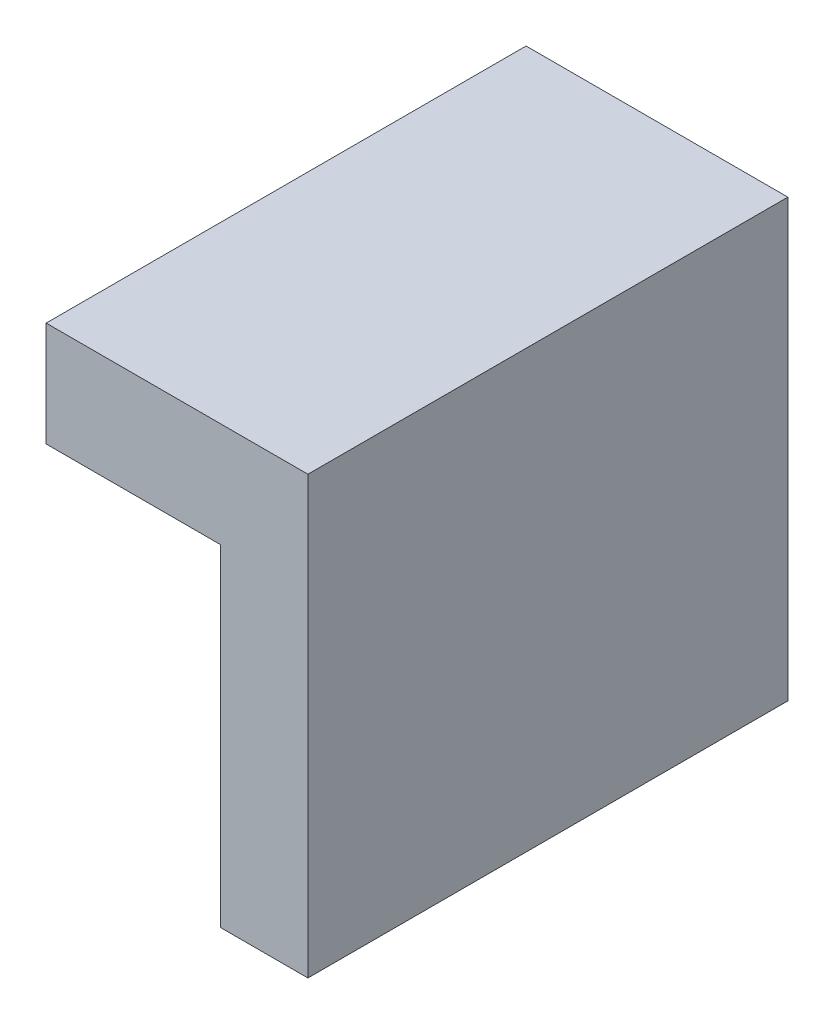
ISO-10303-21;
HEADER;
FILE_DESCRIPTION(('STEP AP214'),'2;1');
FILE_NAME('part.step','',(''),(''),'','','');
FILE_SCHEMA(('AUTOMOTIVE_DESIGN { 1 0 10303 214 1 1 1 1 }'));
ENDSEC;
DATA;
#1=APPLICATION_CONTEXT('core data for automotive mechanical design processes');
#2=APPLICATION_PROTOCOL_DEFINITION('international standard','automotive_design',2000,#1);
#3=PRODUCT_CONTEXT('',#1,'mechanical');
#4=PRODUCT('Part','Part','',(#3));
#5=PRODUCT_RELATED_PRODUCT_CATEGORY('part','',(#4));
#6=PRODUCT_DEFINITION_FORMATION('','',#4);
#7=PRODUCT_DEFINITION_CONTEXT('part definition',#1,'design');
#8=PRODUCT_DEFINITION('design','',#6,#7);
#9=PRODUCT_DEFINITION_SHAPE('','',#8);
#10=(LENGTH_UNIT() NAMED_UNIT(*) SI_UNIT(.MILLI.,.METRE.));
#11=(NAMED_UNIT(*) PLANE_ANGLE_UNIT() SI_UNIT($,.RADIAN.));
#12=(NAMED_UNIT(*) SI_UNIT($,.STERADIAN.) SOLID_ANGLE_UNIT());
#13=UNCERTAINTY_MEASURE_WITH_UNIT(LENGTH_MEASURE(1.E-05),#10,'distance_accuracy_value','');
#14=(GEOMETRIC_REPRESENTATION_CONTEXT(3) GLOBAL_UNCERTAINTY_ASSIGNED_CONTEXT((#13)) GLOBAL_UNIT_ASSIGNED_CONTEXT((#10,
#11,#12)) REPRESENTATION_CONTEXT('',''));
#15=CARTESIAN_POINT('',(0.,0.,0.));
#16=DIRECTION('',(0.,0.,1.));
#17=DIRECTION('',(1.,0.,0.));
#18=AXIS2_PLACEMENT_3D('',#15,#16,#17);
#19=CARTESIAN_POINT('',(0.,0.,50.));
#20=DIRECTION('',(0.,0.,1.));
#21=DIRECTION('',(1.,0.,0.));
#22=AXIS2_PLACEMENT_3D('',#19,#20,#21);
#23=PLANE('',#22);
#24=DIRECTION('',(-1.,0.,0.));
#25=VECTOR('',#24,1.);
#26=CARTESIAN_POINT('',(0.,20.,50.));
#27=LINE('',#26,#25);
#28=CARTESIAN_POINT('',(12.,20.,50.));
#29=VERTEX_POINT('',#28);
#30=CARTESIAN_POINT('',(-15.,20.,50.));
#31=VERTEX_POINT('',#30);
#32=EDGE_CURVE('E12',#29,#31,#27,.T.);
#33=ORIENTED_EDGE('',*,*,#32,.F.);
#34=DIRECTION('',(0.,1.,0.));
#35=VECTOR('',#34,1.);
#36=CARTESIAN_POINT('',(12.,0.,50.));
#37=LINE('',#36,#35);
#38=CARTESIAN_POINT('',(12.,-25.,50.));
#39=VERTEX_POINT('',#38);
#40=EDGE_CURVE('E83',#39,#29,#37,.T.);
#41=ORIENTED_EDGE('',*,*,#40,.F.);
#42=DIRECTION('',(1.,0.,0.));
#43=VECTOR('',#42,1.);
#44=CARTESIAN_POINT('',(0.,-25.,50.));
#45=LINE('',#44,#43);
#46=CARTESIAN_POINT('',(9.,-25.,50.));
#47=VERTEX_POINT('',#46);
#48=EDGE_CURVE('E199',#47,#39,#45,.T.);
#49=ORIENTED_EDGE('',*,*,#48,.F.);
#50=DIRECTION('',(0.,-1.,0.));
#51=VECTOR('',#50,1.);
#52=CARTESIAN_POINT('',(9.,0.,50.));
#53=LINE('',#52,#51);
#54=CARTESIAN_POINT('',(9.,17.,50.));
#55=VERTEX_POINT('',#54);
#56=EDGE_CURVE('E216',#55,#47,#53,.T.);
#57=ORIENTED_EDGE('',*,*,#56,.F.);
#58=DIRECTION('',(1.,0.,0.));
#59=VECTOR('',#58,1.);
#60=CARTESIAN_POINT('',(0.,17.,50.));
#61=LINE('',#60,#59);
#62=CARTESIAN_POINT('',(-15.,17.,50.));
#63=VERTEX_POINT('',#62);
#64=EDGE_CURVE('E210',#63,#55,#61,.T.);
#65=ORIENTED_EDGE('',*,*,#64,.F.);
#66=DIRECTION('',(0.,1.,0.));
#67=VECTOR('',#66,1.);
#68=CARTESIAN_POINT('',(-15.,0.,50.));
#69=LINE('',#68,#67);
#70=EDGE_CURVE('E197',#63,#31,#69,.T.);
#71=ORIENTED_EDGE('',*,*,#70,.T.);
#72=EDGE_LOOP('',(#33,#41,#49,#57,#65,#71));
#73=FACE_BOUND('',#72,.T.);
#74=ADVANCED_FACE('F75',(#73),#23,.F.);
#75=CARTESIAN_POINT('',(9.,0.,55.));
#76=DIRECTION('',(1.,0.,0.));
#77=DIRECTION('',(0.,1.,0.));
#78=AXIS2_PLACEMENT_3D('',#75,#76,#77);
#79=PLANE('',#78);
#80=DIRECTION('',(0.,0.,-1.));
#81=VECTOR('',#80,1.);
#82=CARTESIAN_POINT('',(9.,17.,55.));
#83=LINE('',#82,#81);
#84=CARTESIAN_POINT('',(9.,17.,0.));
#85=VERTEX_POINT('',#84);
#86=EDGE_CURVE('E249',#55,#85,#83,.T.);
#87=ORIENTED_EDGE('',*,*,#86,.F.);
#88=ORIENTED_EDGE('',*,*,#56,.T.);
#89=DIRECTION('',(0.,0.,-1.));
#90=VECTOR('',#89,1.);
#91=CARTESIAN_POINT('',(9.,-25.,55.));
#92=LINE('',#91,#90);
#93=CARTESIAN_POINT('',(9.,-25.,0.));
#94=VERTEX_POINT('',#93);
#95=EDGE_CURVE('E251',#47,#94,#92,.T.);
#96=ORIENTED_EDGE('',*,*,#95,.T.);
#97=DIRECTION('',(0.,-1.,0.));
#98=VECTOR('',#97,1.);
#99=CARTESIAN_POINT('',(9.,0.,0.));
#100=LINE('',#99,#98);
#101=EDGE_CURVE('E238',#85,#94,#100,.T.);
#102=ORIENTED_EDGE('',*,*,#101,.F.);
#103=EDGE_LOOP('',(#87,#88,#96,#102));
#104=FACE_BOUND('',#103,.T.);
#105=ADVANCED_FACE('F281',(#104),#79,.T.);
#106=CARTESIAN_POINT('',(0.,17.,55.));
#107=DIRECTION('',(0.,1.,0.));
#108=DIRECTION('',(0.,0.,1.));
#109=AXIS2_PLACEMENT_3D('',#106,#107,#108);
#110=PLANE('',#109);
#111=DIRECTION('',(0.,0.,-1.));
#112=VECTOR('',#111,1.);
#113=CARTESIAN_POINT('',(-15.,17.,55.));
#114=LINE('',#113,#112);
#115=CARTESIAN_POINT('',(-15.,17.,0.));
#116=VERTEX_POINT('',#115);
#117=EDGE_CURVE('E247',#63,#116,#114,.T.);
#118=ORIENTED_EDGE('',*,*,#117,.F.);
#119=ORIENTED_EDGE('',*,*,#64,.T.);
#120=ORIENTED_EDGE('',*,*,#86,.T.);
#121=DIRECTION('',(1.,0.,0.));
#122=VECTOR('',#121,1.);
#123=CARTESIAN_POINT('',(0.,17.,0.));
#124=LINE('',#123,#122);
#125=EDGE_CURVE('E241',#116,#85,#124,.T.);
#126=ORIENTED_EDGE('',*,*,#125,.F.);
#127=EDGE_LOOP('',(#118,#119,#120,#126));
#128=FACE_BOUND('',#127,.T.);
#129=ADVANCED_FACE('F276',(#128),#110,.T.);
#130=CARTESIAN_POINT('',(0.,13.,55.));
#131=DIRECTION('',(0.,1.,0.));
#132=DIRECTION('',(0.,0.,1.));
#133=AXIS2_PLACEMENT_3D('',#130,#131,#132);
#134=PLANE('',#133);
#135=DIRECTION('',(0.,0.,-1.));
#136=VECTOR('',#135,1.);
#137=CARTESIAN_POINT('',(-15.,13.,55.));
#138=LINE('',#137,#136);
#139=CARTESIAN_POINT('',(-15.,13.,55.));
#140=VERTEX_POINT('',#139);
#141=CARTESIAN_POINT('',(-15.,13.,0.));
#142=VERTEX_POINT('',#141);
#143=EDGE_CURVE('E229',#140,#142,#138,.T.);
#144=ORIENTED_EDGE('',*,*,#143,.T.);
#145=DIRECTION('',(1.,0.,0.));
#146=VECTOR('',#145,1.);
#147=CARTESIAN_POINT('',(0.,13.,0.));
#148=LINE('',#147,#146);
#149=CARTESIAN_POINT('',(5.,13.,0.));
#150=VERTEX_POINT('',#149);
#151=EDGE_CURVE('E218',#142,#150,#148,.T.);
#152=ORIENTED_EDGE('',*,*,#151,.T.);
#153=DIRECTION('',(0.,0.,-1.));
#154=VECTOR('',#153,1.);
#155=CARTESIAN_POINT('',(5.,13.,55.));
#156=LINE('',#155,#154);
#157=CARTESIAN_POINT('',(5.,13.,55.));
#158=VERTEX_POINT('',#157);
#159=EDGE_CURVE('E255',#158,#150,#156,.T.);
#160=ORIENTED_EDGE('',*,*,#159,.F.);
#161=DIRECTION('',(1.,0.,0.));
#162=VECTOR('',#161,1.);
#163=CARTESIAN_POINT('',(0.,13.,55.));
#164=LINE('',#163,#162);
#165=EDGE_CURVE('E219',#140,#158,#164,.T.);
#166=ORIENTED_EDGE('',*,*,#165,.F.);
#167=EDGE_LOOP('',(#144,#152,#160,#166));
#168=FACE_BOUND('',#167,.T.);
#169=ADVANCED_FACE('F77',(#168),#134,.F.);
#170=CARTESIAN_POINT('',(5.,0.,55.));
#171=DIRECTION('',(1.,0.,0.));
#172=DIRECTION('',(0.,1.,0.));
#173=AXIS2_PLACEMENT_3D('',#170,#171,#172);
#174=PLANE('',#173);
#175=ORIENTED_EDGE('',*,*,#159,.T.);
#176=DIRECTION('',(0.,-1.,0.));
#177=VECTOR('',#176,1.);
#178=CARTESIAN_POINT('',(5.,0.,0.));
#179=LINE('',#178,#177);
#180=CARTESIAN_POINT('',(5.,-25.,0.));
#181=VERTEX_POINT('',#180);
#182=EDGE_CURVE('E232',#150,#181,#179,.T.);
#183=ORIENTED_EDGE('',*,*,#182,.T.);
#184=DIRECTION('',(0.,0.,-1.));
#185=VECTOR('',#184,1.);
#186=CARTESIAN_POINT('',(5.,-25.,55.));
#187=LINE('',#186,#185);
#188=CARTESIAN_POINT('',(5.,-25.,55.));
#189=VERTEX_POINT('',#188);
#190=EDGE_CURVE('E253',#189,#181,#187,.T.);
#191=ORIENTED_EDGE('',*,*,#190,.F.);
#192=DIRECTION('',(0.,-1.,0.));
#193=VECTOR('',#192,1.);
#194=CARTESIAN_POINT('',(5.,0.,55.));
#195=LINE('',#194,#193);
#196=EDGE_CURVE('E222',#158,#189,#195,.T.);
#197=ORIENTED_EDGE('',*,*,#196,.F.);
#198=EDGE_LOOP('',(#175,#183,#191,#197));
#199=FACE_BOUND('',#198,.T.);
#200=ADVANCED_FACE('F259',(#199),#174,.F.);
#201=CARTESIAN_POINT('',(0.,-25.,55.));
#202=DIRECTION('',(0.,1.,0.));
#203=DIRECTION('',(0.,0.,1.));
#204=AXIS2_PLACEMENT_3D('',#201,#202,#203);
#205=PLANE('',#204);
#206=DIRECTION('',(0.,0.,1.));
#207=VECTOR('',#206,1.);
#208=CARTESIAN_POINT('',(15.,-25.,50.));
#209=LINE('',#208,#207);
#210=CARTESIAN_POINT('',(15.,-25.,0.));
#211=VERTEX_POINT('',#210);
#212=CARTESIAN_POINT('',(15.,-25.,55.));
#213=VERTEX_POINT('',#212);
#214=EDGE_CURVE('E202',#211,#213,#209,.T.);
#215=ORIENTED_EDGE('',*,*,#214,.T.);
#216=DIRECTION('',(1.,0.,0.));
#217=VECTOR('',#216,1.);
#218=CARTESIAN_POINT('',(0.,-25.,55.));
#219=LINE('',#218,#217);
#220=EDGE_CURVE('E225',#189,#213,#219,.T.);
#221=ORIENTED_EDGE('',*,*,#220,.F.);
#222=ORIENTED_EDGE('',*,*,#190,.T.);
#223=DIRECTION('',(1.,0.,0.));
#224=VECTOR('',#223,1.);
#225=CARTESIAN_POINT('',(0.,-25.,0.));
#226=LINE('',#225,#224);
#227=EDGE_CURVE('E235',#181,#94,#226,.T.);
#228=ORIENTED_EDGE('',*,*,#227,.T.);
#229=ORIENTED_EDGE('',*,*,#95,.F.);
#230=ORIENTED_EDGE('',*,*,#48,.T.);
#231=DIRECTION('',(0.,0.,-1.));
#232=VECTOR('',#231,1.);
#233=CARTESIAN_POINT('',(12.,-25.,55.));
#234=LINE('',#233,#232);
#235=CARTESIAN_POINT('',(12.,-25.,0.));
#236=VERTEX_POINT('',#235);
#237=EDGE_CURVE('E169',#39,#236,#234,.T.);
#238=ORIENTED_EDGE('',*,*,#237,.T.);
#239=DIRECTION('',(1.,0.,0.));
#240=VECTOR('',#239,1.);
#241=CARTESIAN_POINT('',(0.,-25.,0.));
#242=LINE('',#241,#240);
#243=EDGE_CURVE('E179',#236,#211,#242,.T.);
#244=ORIENTED_EDGE('',*,*,#243,.T.);
#245=EDGE_LOOP('',(#215,#221,#222,#228,#229,#230,#238,#244));
#246=FACE_BOUND('',#245,.T.);
#247=ADVANCED_FACE('F284',(#246),#205,.F.);
#248=CARTESIAN_POINT('',(-15.,0.,55.));
#249=DIRECTION('',(-1.,0.,0.));
#250=DIRECTION('',(0.,0.,1.));
#251=AXIS2_PLACEMENT_3D('',#248,#249,#250);
#252=PLANE('',#251);
#253=DIRECTION('',(0.,0.,-1.));
#254=VECTOR('',#253,1.);
#255=CARTESIAN_POINT('',(-15.,20.,55.));
#256=LINE('',#255,#254);
#257=CARTESIAN_POINT('',(-15.,20.,0.));
#258=VERTEX_POINT('',#257);
#259=EDGE_CURVE('E183',#31,#258,#256,.T.);
#260=ORIENTED_EDGE('',*,*,#259,.F.);
#261=ORIENTED_EDGE('',*,*,#70,.F.);
#262=ORIENTED_EDGE('',*,*,#117,.T.);
#263=DIRECTION('',(0.,1.,0.));
#264=VECTOR('',#263,1.);
#265=CARTESIAN_POINT('',(-15.,0.,0.));
#266=LINE('',#265,#264);
#267=EDGE_CURVE('E223',#142,#116,#266,.T.);
#268=ORIENTED_EDGE('',*,*,#267,.F.);
#269=ORIENTED_EDGE('',*,*,#143,.F.);
#270=DIRECTION('',(0.,1.,0.));
#271=VECTOR('',#270,1.);
#272=CARTESIAN_POINT('',(-15.,0.,55.));
#273=LINE('',#272,#271);
#274=CARTESIAN_POINT('',(-15.,25.,55.));
#275=VERTEX_POINT('',#274);
#276=EDGE_CURVE('E227',#140,#275,#273,.T.);
#277=ORIENTED_EDGE('',*,*,#276,.T.);
#278=DIRECTION('',(0.,0.,1.));
#279=VECTOR('',#278,1.);
#280=CARTESIAN_POINT('',(-15.,25.,50.));
#281=LINE('',#280,#279);
#282=CARTESIAN_POINT('',(-15.,25.,0.));
#283=VERTEX_POINT('',#282);
#284=EDGE_CURVE('E207',#283,#275,#281,.T.);
#285=ORIENTED_EDGE('',*,*,#284,.F.);
#286=DIRECTION('',(0.,1.,0.));
#287=VECTOR('',#286,1.);
#288=CARTESIAN_POINT('',(-15.,0.,0.));
#289=LINE('',#288,#287);
#290=EDGE_CURVE('E193',#258,#283,#289,.T.);
#291=ORIENTED_EDGE('',*,*,#290,.F.);
#292=EDGE_LOOP('',(#260,#261,#262,#268,#269,#277,#285,#291));
#293=FACE_BOUND('',#292,.T.);
#294=ADVANCED_FACE('F270',(#293),#252,.T.);
#295=CARTESIAN_POINT('',(0.,0.,55.));
#296=DIRECTION('',(0.,0.,1.));
#297=DIRECTION('',(1.,0.,0.));
#298=AXIS2_PLACEMENT_3D('',#295,#296,#297);
#299=PLANE('',#298);
#300=DIRECTION('',(1.,0.,0.));
#301=VECTOR('',#300,1.);
#302=CARTESIAN_POINT('',(0.,25.,55.));
#303=LINE('',#302,#301);
#304=CARTESIAN_POINT('',(15.,25.,55.));
#305=VERTEX_POINT('',#304);
#306=EDGE_CURVE('E200',#275,#305,#303,.T.);
#307=ORIENTED_EDGE('',*,*,#306,.F.);
#308=ORIENTED_EDGE('',*,*,#276,.F.);
#309=ORIENTED_EDGE('',*,*,#165,.T.);
#310=ORIENTED_EDGE('',*,*,#196,.T.);
#311=ORIENTED_EDGE('',*,*,#220,.T.);
#312=DIRECTION('',(0.,1.,0.));
#313=VECTOR('',#312,1.);
#314=CARTESIAN_POINT('',(15.,0.,55.));
#315=LINE('',#314,#313);
#316=EDGE_CURVE('E168',#213,#305,#315,.T.);
#317=ORIENTED_EDGE('',*,*,#316,.T.);
#318=EDGE_LOOP('',(#307,#308,#309,#310,#311,#317));
#319=FACE_BOUND('',#318,.T.);
#320=ADVANCED_FACE('F288',(#319),#299,.T.);
#321=CARTESIAN_POINT('',(0.,0.,0.));
#322=DIRECTION('',(0.,0.,1.));
#323=DIRECTION('',(1.,0.,0.));
#324=AXIS2_PLACEMENT_3D('',#321,#322,#323);
#325=PLANE('',#324);
#326=ORIENTED_EDGE('',*,*,#151,.F.);
#327=ORIENTED_EDGE('',*,*,#267,.T.);
#328=ORIENTED_EDGE('',*,*,#125,.T.);
#329=ORIENTED_EDGE('',*,*,#101,.T.);
#330=ORIENTED_EDGE('',*,*,#227,.F.);
#331=ORIENTED_EDGE('',*,*,#182,.F.);
#332=EDGE_LOOP('',(#326,#327,#328,#329,#330,#331));
#333=FACE_BOUND('',#332,.T.);
#334=ADVANCED_FACE('F266',(#333),#325,.F.);
#335=CARTESIAN_POINT('',(0.,25.,50.));
#336=DIRECTION('',(0.,-1.,0.));
#337=DIRECTION('',(0.,0.,-1.));
#338=AXIS2_PLACEMENT_3D('',#335,#336,#337);
#339=PLANE('',#338);
#340=ORIENTED_EDGE('',*,*,#306,.T.);
#341=DIRECTION('',(0.,0.,1.));
#342=VECTOR('',#341,1.);
#343=CARTESIAN_POINT('',(15.,25.,50.));
#344=LINE('',#343,#342);
#345=CARTESIAN_POINT('',(15.,25.,0.));
#346=VERTEX_POINT('',#345);
#347=EDGE_CURVE('E211',#346,#305,#344,.T.);
#348=ORIENTED_EDGE('',*,*,#347,.F.);
#349=DIRECTION('',(1.,0.,0.));
#350=VECTOR('',#349,1.);
#351=CARTESIAN_POINT('',(0.,25.,0.));
#352=LINE('',#351,#350);
#353=EDGE_CURVE('E190',#283,#346,#352,.T.);
#354=ORIENTED_EDGE('',*,*,#353,.F.);
#355=ORIENTED_EDGE('',*,*,#284,.T.);
#356=EDGE_LOOP('',(#340,#348,#354,#355));
#357=FACE_BOUND('',#356,.T.);
#358=ADVANCED_FACE('F291',(#357),#339,.F.);
#359=CARTESIAN_POINT('',(15.,0.,50.));
#360=DIRECTION('',(1.,0.,0.));
#361=DIRECTION('',(0.,0.,-1.));
#362=AXIS2_PLACEMENT_3D('',#359,#360,#361);
#363=PLANE('',#362);
#364=ORIENTED_EDGE('',*,*,#316,.F.);
#365=ORIENTED_EDGE('',*,*,#214,.F.);
#366=DIRECTION('',(0.,1.,0.));
#367=VECTOR('',#366,1.);
#368=CARTESIAN_POINT('',(15.,0.,0.));
#369=LINE('',#368,#367);
#370=EDGE_CURVE('E187',#211,#346,#369,.T.);
#371=ORIENTED_EDGE('',*,*,#370,.T.);
#372=ORIENTED_EDGE('',*,*,#347,.T.);
#373=EDGE_LOOP('',(#364,#365,#371,#372));
#374=FACE_BOUND('',#373,.T.);
#375=ADVANCED_FACE('F293',(#374),#363,.T.);
#376=CARTESIAN_POINT('',(0.,20.,55.));
#377=DIRECTION('',(0.,1.,0.));
#378=DIRECTION('',(0.,0.,1.));
#379=AXIS2_PLACEMENT_3D('',#376,#377,#378);
#380=PLANE('',#379);
#381=DIRECTION('',(0.,0.,-1.));
#382=VECTOR('',#381,1.);
#383=CARTESIAN_POINT('',(12.,20.,55.));
#384=LINE('',#383,#382);
#385=CARTESIAN_POINT('',(12.,20.,0.));
#386=VERTEX_POINT('',#385);
#387=EDGE_CURVE('E160',#29,#386,#384,.T.);
#388=ORIENTED_EDGE('',*,*,#387,.F.);
#389=ORIENTED_EDGE('',*,*,#32,.T.);
#390=ORIENTED_EDGE('',*,*,#259,.T.);
#391=DIRECTION('',(1.,0.,0.));
#392=VECTOR('',#391,1.);
#393=CARTESIAN_POINT('',(0.,20.,0.));
#394=LINE('',#393,#392);
#395=EDGE_CURVE('E175',#258,#386,#394,.T.);
#396=ORIENTED_EDGE('',*,*,#395,.T.);
#397=EDGE_LOOP('',(#388,#389,#390,#396));
#398=FACE_BOUND('',#397,.T.);
#399=ADVANCED_FACE('F181',(#398),#380,.F.);
#400=CARTESIAN_POINT('',(12.,0.,55.));
#401=DIRECTION('',(1.,0.,0.));
#402=DIRECTION('',(0.,1.,0.));
#403=AXIS2_PLACEMENT_3D('',#400,#401,#402);
#404=PLANE('',#403);
#405=ORIENTED_EDGE('',*,*,#237,.F.);
#406=ORIENTED_EDGE('',*,*,#40,.T.);
#407=ORIENTED_EDGE('',*,*,#387,.T.);
#408=DIRECTION('',(0.,-1.,0.));
#409=VECTOR('',#408,1.);
#410=CARTESIAN_POINT('',(12.,0.,0.));
#411=LINE('',#410,#409);
#412=EDGE_CURVE('E164',#386,#236,#411,.T.);
#413=ORIENTED_EDGE('',*,*,#412,.T.);
#414=EDGE_LOOP('',(#405,#406,#407,#413));
#415=FACE_BOUND('',#414,.T.);
#416=ADVANCED_FACE('F163',(#415),#404,.F.);
#417=CARTESIAN_POINT('',(0.,0.,0.));
#418=DIRECTION('',(0.,0.,1.));
#419=DIRECTION('',(1.,0.,0.));
#420=AXIS2_PLACEMENT_3D('',#417,#418,#419);
#421=PLANE('',#420);
#422=ORIENTED_EDGE('',*,*,#395,.F.);
#423=ORIENTED_EDGE('',*,*,#290,.T.);
#424=ORIENTED_EDGE('',*,*,#353,.T.);
#425=ORIENTED_EDGE('',*,*,#370,.F.);
#426=ORIENTED_EDGE('',*,*,#243,.F.);
#427=ORIENTED_EDGE('',*,*,#412,.F.);
#428=EDGE_LOOP('',(#422,#423,#424,#425,#426,#427));
#429=FACE_BOUND('',#428,.T.);
#430=ADVANCED_FACE('F173',(#429),#421,.F.);
#431=CLOSED_SHELL('',(#74,#105,#129,#169,#200,#247,#294,#320,#334,#358,#375,#399,#416,#430));
#432=MANIFOLD_SOLID_BREP('B2',#431);
#433=ADVANCED_BREP_SHAPE_REPRESENTATION('',(#18,#432),#14);
#434=SHAPE_DEFINITION_REPRESENTATION(#9,#433);
ENDSEC;
END-ISO-10303-21;
